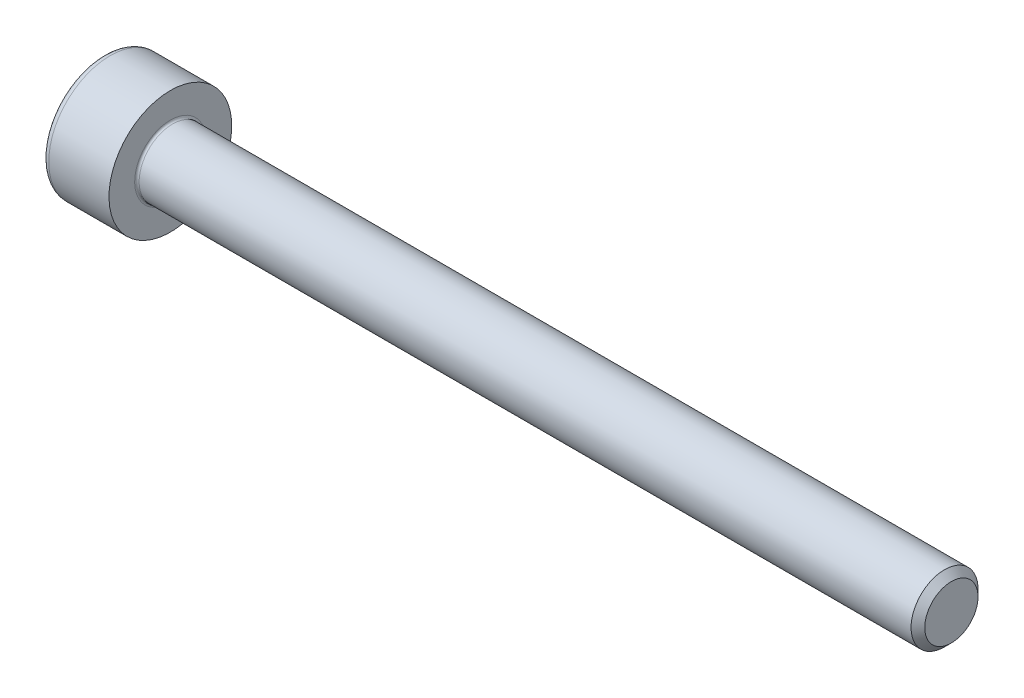
ISO-10303-21;
HEADER;
FILE_DESCRIPTION(('STEP AP214'),'2;1');
FILE_NAME('part.step','',(''),(''),'','','');
FILE_SCHEMA(('AUTOMOTIVE_DESIGN { 1 0 10303 214 1 1 1 1 }'));
ENDSEC;
DATA;
#1=APPLICATION_CONTEXT('core data for automotive mechanical design processes');
#2=APPLICATION_PROTOCOL_DEFINITION('international standard','automotive_design',2000,#1);
#3=PRODUCT_CONTEXT('',#1,'mechanical');
#4=PRODUCT('Part','Part','',(#3));
#5=PRODUCT_RELATED_PRODUCT_CATEGORY('part','',(#4));
#6=PRODUCT_DEFINITION_FORMATION('','',#4);
#7=PRODUCT_DEFINITION_CONTEXT('part definition',#1,'design');
#8=PRODUCT_DEFINITION('design','',#6,#7);
#9=PRODUCT_DEFINITION_SHAPE('','',#8);
#10=(LENGTH_UNIT() NAMED_UNIT(*) SI_UNIT(.MILLI.,.METRE.));
#11=(NAMED_UNIT(*) PLANE_ANGLE_UNIT() SI_UNIT($,.RADIAN.));
#12=(NAMED_UNIT(*) SI_UNIT($,.STERADIAN.) SOLID_ANGLE_UNIT());
#13=UNCERTAINTY_MEASURE_WITH_UNIT(LENGTH_MEASURE(1.E-05),#10,'distance_accuracy_value','');
#14=(GEOMETRIC_REPRESENTATION_CONTEXT(3) GLOBAL_UNCERTAINTY_ASSIGNED_CONTEXT((#13)) GLOBAL_UNIT_ASSIGNED_CONTEXT((#10,
#11,#12)) REPRESENTATION_CONTEXT('',''));
#15=CARTESIAN_POINT('',(0.,0.,0.));
#16=DIRECTION('',(0.,0.,1.));
#17=DIRECTION('',(1.,0.,0.));
#18=AXIS2_PLACEMENT_3D('',#15,#16,#17);
#19=CARTESIAN_POINT('',(0.100000000000002,0.,0.));
#20=DIRECTION('',(1.,0.,0.));
#21=DIRECTION('',(0.,1.,0.));
#22=AXIS2_PLACEMENT_3D('',#19,#20,#21);
#23=TOROIDAL_SURFACE('',#22,1.6,0.1);
#24=CARTESIAN_POINT('',(0.,0.,0.));
#25=DIRECTION('',(1.,0.,0.));
#26=DIRECTION('',(0.,1.,0.));
#27=AXIS2_PLACEMENT_3D('',#24,#25,#26);
#28=CIRCLE('',#27,1.6);
#29=CARTESIAN_POINT('',(0.,1.6,0.));
#30=VERTEX_POINT('',#29);
#31=EDGE_CURVE('E11',#30,#30,#28,.T.);
#32=ORIENTED_EDGE('',*,*,#31,.T.);
#33=EDGE_LOOP('',(#32));
#34=FACE_BOUND('',#33,.T.);
#35=CARTESIAN_POINT('',(0.100000000000002,0.,0.));
#36=DIRECTION('',(-1.,0.,0.));
#37=DIRECTION('',(0.,1.,0.));
#38=AXIS2_PLACEMENT_3D('',#35,#36,#37);
#39=CIRCLE('',#38,1.5);
#40=CARTESIAN_POINT('',(0.100000000000002,1.5,0.));
#41=VERTEX_POINT('',#40);
#42=EDGE_CURVE('E27',#41,#41,#39,.T.);
#43=ORIENTED_EDGE('',*,*,#42,.T.);
#44=EDGE_LOOP('',(#43));
#45=FACE_BOUND('',#44,.T.);
#46=ADVANCED_FACE('F16',(#34,#45),#23,.F.);
#47=CARTESIAN_POINT('',(26.,0.,0.));
#48=DIRECTION('',(1.,0.,0.));
#49=DIRECTION('',(0.,1.,0.));
#50=AXIS2_PLACEMENT_3D('',#47,#48,#49);
#51=CYLINDRICAL_SURFACE('',#50,1.5);
#52=CARTESIAN_POINT('',(34.693275,0.,0.));
#53=DIRECTION('',(1.,0.,0.));
#54=DIRECTION('',(0.,1.,0.));
#55=AXIS2_PLACEMENT_3D('',#52,#53,#54);
#56=CIRCLE('',#55,1.5);
#57=CARTESIAN_POINT('',(34.693275,1.5,0.));
#58=VERTEX_POINT('',#57);
#59=EDGE_CURVE('E161',#58,#58,#56,.T.);
#60=ORIENTED_EDGE('',*,*,#59,.F.);
#61=EDGE_LOOP('',(#60));
#62=FACE_BOUND('',#61,.T.);
#63=ORIENTED_EDGE('',*,*,#42,.F.);
#64=EDGE_LOOP('',(#63));
#65=FACE_BOUND('',#64,.T.);
#66=ADVANCED_FACE('F171',(#62,#65),#51,.T.);
#67=CARTESIAN_POINT('',(0.,2.125,0.));
#68=DIRECTION('',(1.,0.,0.));
#69=DIRECTION('',(0.,1.,0.));
#70=AXIS2_PLACEMENT_3D('',#67,#68,#69);
#71=PLANE('',#70);
#72=CARTESIAN_POINT('',(0.,0.,0.));
#73=DIRECTION('',(1.,0.,0.));
#74=DIRECTION('',(0.,1.,0.));
#75=AXIS2_PLACEMENT_3D('',#72,#73,#74);
#76=CIRCLE('',#75,2.75);
#77=CARTESIAN_POINT('',(0.,2.75,0.));
#78=VERTEX_POINT('',#77);
#79=EDGE_CURVE('E162',#78,#78,#76,.T.);
#80=ORIENTED_EDGE('',*,*,#79,.T.);
#81=EDGE_LOOP('',(#80));
#82=FACE_BOUND('',#81,.T.);
#83=ORIENTED_EDGE('',*,*,#31,.F.);
#84=EDGE_LOOP('',(#83));
#85=FACE_BOUND('',#84,.T.);
#86=ADVANCED_FACE('F173',(#82,#85),#71,.T.);
#87=CARTESIAN_POINT('',(34.8466375,0.,0.));
#88=DIRECTION('',(-1.,0.,0.));
#89=DIRECTION('',(0.,1.,0.));
#90=AXIS2_PLACEMENT_3D('',#87,#88,#89);
#91=CONICAL_SURFACE('',#90,1.3466375,0.785398163397445);
#92=ORIENTED_EDGE('',*,*,#59,.T.);
#93=EDGE_LOOP('',(#92));
#94=FACE_BOUND('',#93,.T.);
#95=CARTESIAN_POINT('',(35.,0.,0.));
#96=DIRECTION('',(-1.,0.,0.));
#97=DIRECTION('',(0.,1.,0.));
#98=AXIS2_PLACEMENT_3D('',#95,#96,#97);
#99=CIRCLE('',#98,1.193275);
#100=CARTESIAN_POINT('',(35.,1.193275,0.));
#101=VERTEX_POINT('',#100);
#102=EDGE_CURVE('E158',#101,#101,#99,.T.);
#103=ORIENTED_EDGE('',*,*,#102,.T.);
#104=EDGE_LOOP('',(#103));
#105=FACE_BOUND('',#104,.T.);
#106=ADVANCED_FACE('F181',(#94,#105),#91,.T.);
#107=CARTESIAN_POINT('',(35.,0.750000000000001,0.));
#108=DIRECTION('',(1.,0.,0.));
#109=DIRECTION('',(0.,1.,0.));
#110=AXIS2_PLACEMENT_3D('',#107,#108,#109);
#111=PLANE('',#110);
#112=ORIENTED_EDGE('',*,*,#102,.F.);
#113=EDGE_LOOP('',(#112));
#114=FACE_BOUND('',#113,.T.);
#115=ADVANCED_FACE('F191',(#114),#111,.T.);
#116=CARTESIAN_POINT('',(-2.69999999999999,0.,0.));
#117=DIRECTION('',(1.,0.,0.));
#118=DIRECTION('',(0.,1.,0.));
#119=AXIS2_PLACEMENT_3D('',#116,#117,#118);
#120=TOROIDAL_SURFACE('',#119,2.45,0.3);
#121=CARTESIAN_POINT('',(-2.99999999999999,0.,0.));
#122=DIRECTION('',(1.,0.,0.));
#123=DIRECTION('',(0.,1.,0.));
#124=AXIS2_PLACEMENT_3D('',#121,#122,#123);
#125=CIRCLE('',#124,2.45);
#126=CARTESIAN_POINT('',(-2.99999999999999,2.45,0.));
#127=VERTEX_POINT('',#126);
#128=EDGE_CURVE('E155',#127,#127,#125,.T.);
#129=ORIENTED_EDGE('',*,*,#128,.T.);
#130=EDGE_LOOP('',(#129));
#131=FACE_BOUND('',#130,.T.);
#132=CARTESIAN_POINT('',(-2.69999999999999,0.,0.));
#133=DIRECTION('',(-1.,0.,0.));
#134=DIRECTION('',(0.,1.,0.));
#135=AXIS2_PLACEMENT_3D('',#132,#133,#134);
#136=CIRCLE('',#135,2.75);
#137=CARTESIAN_POINT('',(-2.69999999999999,2.75,0.));
#138=VERTEX_POINT('',#137);
#139=EDGE_CURVE('E152',#138,#138,#136,.T.);
#140=ORIENTED_EDGE('',*,*,#139,.T.);
#141=EDGE_LOOP('',(#140));
#142=FACE_BOUND('',#141,.T.);
#143=ADVANCED_FACE('F205',(#131,#142),#120,.T.);
#144=CARTESIAN_POINT('',(-2.99999999999999,2.09668783648703,0.));
#145=DIRECTION('',(-1.,0.,0.));
#146=DIRECTION('',(0.,-1.,0.));
#147=AXIS2_PLACEMENT_3D('',#144,#145,#146);
#148=PLANE('',#147);
#149=DIRECTION('',(0.,0.,1.));
#150=VECTOR('',#149,1.);
#151=CARTESIAN_POINT('',(-2.99999999999999,1.25,0.360843918243515));
#152=LINE('',#151,#150);
#153=CARTESIAN_POINT('',(-2.99999999999999,1.25,-0.721687836487033));
#154=VERTEX_POINT('',#153);
#155=CARTESIAN_POINT('',(-2.99999999999999,1.25,0.72168783648703));
#156=VERTEX_POINT('',#155);
#157=EDGE_CURVE('E150',#154,#156,#152,.T.);
#158=ORIENTED_EDGE('',*,*,#157,.T.);
#159=DIRECTION('',(0.,-0.866025403784438,0.500000000000001));
#160=VECTOR('',#159,1.);
#161=CARTESIAN_POINT('',(-2.99999999999999,0.3125,1.26295371385231));
#162=LINE('',#161,#160);
#163=CARTESIAN_POINT('',(-2.99999999999999,0.,1.44337567297406));
#164=VERTEX_POINT('',#163);
#165=EDGE_CURVE('E39',#156,#164,#162,.T.);
#166=ORIENTED_EDGE('',*,*,#165,.T.);
#167=DIRECTION('',(0.,-0.866025403784439,-0.5));
#168=VECTOR('',#167,1.);
#169=CARTESIAN_POINT('',(-2.99999999999999,-0.9375,0.902109795608791));
#170=LINE('',#169,#168);
#171=CARTESIAN_POINT('',(-2.99999999999999,-1.25,0.721687836487033));
#172=VERTEX_POINT('',#171);
#173=EDGE_CURVE('E95',#164,#172,#170,.T.);
#174=ORIENTED_EDGE('',*,*,#173,.T.);
#175=DIRECTION('',(0.,0.,-1.));
#176=VECTOR('',#175,1.);
#177=CARTESIAN_POINT('',(-2.99999999999999,-1.25,-0.360843918243516));
#178=LINE('',#177,#176);
#179=CARTESIAN_POINT('',(-2.99999999999999,-1.25,-0.721687836487032));
#180=VERTEX_POINT('',#179);
#181=EDGE_CURVE('E88',#172,#180,#178,.T.);
#182=ORIENTED_EDGE('',*,*,#181,.T.);
#183=DIRECTION('',(0.,0.866025403784439,-0.5));
#184=VECTOR('',#183,1.);
#185=CARTESIAN_POINT('',(-2.99999999999999,-0.3125,-1.26295371385231));
#186=LINE('',#185,#184);
#187=CARTESIAN_POINT('',(-2.99999999999999,0.,-1.44337567297406));
#188=VERTEX_POINT('',#187);
#189=EDGE_CURVE('E144',#180,#188,#186,.T.);
#190=ORIENTED_EDGE('',*,*,#189,.T.);
#191=DIRECTION('',(0.,0.866025403784439,0.5));
#192=VECTOR('',#191,1.);
#193=CARTESIAN_POINT('',(-2.99999999999999,0.9375,-0.902109795608791));
#194=LINE('',#193,#192);
#195=EDGE_CURVE('E135',#188,#154,#194,.T.);
#196=ORIENTED_EDGE('',*,*,#195,.T.);
#197=EDGE_LOOP('',(#158,#166,#174,#182,#190,#196));
#198=FACE_BOUND('',#197,.T.);
#199=ORIENTED_EDGE('',*,*,#128,.F.);
#200=EDGE_LOOP('',(#199));
#201=FACE_BOUND('',#200,.T.);
#202=ADVANCED_FACE('F196',(#198,#201),#148,.T.);
#203=CARTESIAN_POINT('',(-1.49999999999999,0.,0.));
#204=DIRECTION('',(1.,0.,0.));
#205=DIRECTION('',(0.,1.,0.));
#206=AXIS2_PLACEMENT_3D('',#203,#204,#205);
#207=CYLINDRICAL_SURFACE('',#206,2.75);
#208=ORIENTED_EDGE('',*,*,#79,.F.);
#209=EDGE_LOOP('',(#208));
#210=FACE_BOUND('',#209,.T.);
#211=ORIENTED_EDGE('',*,*,#139,.F.);
#212=EDGE_LOOP('',(#211));
#213=FACE_BOUND('',#212,.T.);
#214=ADVANCED_FACE('F193',(#210,#213),#207,.T.);
#215=CARTESIAN_POINT('',(-2.99999999999999,0.,-1.44337567297406));
#216=DIRECTION('',(0.,-0.5,-0.866025403784439));
#217=DIRECTION('',(0.,0.866025403784439,-0.5));
#218=AXIS2_PLACEMENT_3D('',#215,#216,#217);
#219=PLANE('',#218);
#220=CARTESIAN_POINT('',(-1.49999999999999,0.,-1.44337567297407));
#221=CARTESIAN_POINT('',(-1.29166666666665,-0.625000000000001,-1.08253175473055));
#222=CARTESIAN_POINT('',(-1.49999999999999,-1.25000000000001,-0.721687836487024));
#223=(BOUNDED_CURVE() B_SPLINE_CURVE(2,(#220,#221,#222),.UNSPECIFIED.,.F.,
.F.) B_SPLINE_CURVE_WITH_KNOTS((3,3),(0.,0.146054517259743),
.UNSPECIFIED.) CURVE() GEOMETRIC_REPRESENTATION_ITEM() RATIONAL_B_SPLINE_CURVE((1.,
1.15470053837926,1.)) REPRESENTATION_ITEM(''));
#224=CARTESIAN_POINT('',(-1.49999999999999,0.,-1.44337567297406));
#225=VERTEX_POINT('',#224);
#226=CARTESIAN_POINT('',(-1.49999999999999,-1.25,-0.721687836487032));
#227=VERTEX_POINT('',#226);
#228=EDGE_CURVE('E79',#225,#227,#223,.T.);
#229=ORIENTED_EDGE('',*,*,#228,.F.);
#230=DIRECTION('',(-1.,0.,0.));
#231=VECTOR('',#230,1.);
#232=CARTESIAN_POINT('',(-2.24999999999999,0.,-1.44337567297406));
#233=LINE('',#232,#231);
#234=EDGE_CURVE('E125',#225,#188,#233,.T.);
#235=ORIENTED_EDGE('',*,*,#234,.T.);
#236=ORIENTED_EDGE('',*,*,#189,.F.);
#237=DIRECTION('',(-1.,0.,0.));
#238=VECTOR('',#237,1.);
#239=CARTESIAN_POINT('',(-2.24999999999999,-1.25,-0.721687836487033));
#240=LINE('',#239,#238);
#241=EDGE_CURVE('E91',#227,#180,#240,.T.);
#242=ORIENTED_EDGE('',*,*,#241,.F.);
#243=EDGE_LOOP('',(#229,#235,#236,#242));
#244=FACE_BOUND('',#243,.T.);
#245=ADVANCED_FACE('F195',(#244),#219,.F.);
#246=CARTESIAN_POINT('',(-2.99999999999999,1.25,-0.721687836487033));
#247=DIRECTION('',(0.,0.5,-0.866025403784439));
#248=DIRECTION('',(0.,0.866025403784439,0.5));
#249=AXIS2_PLACEMENT_3D('',#246,#247,#248);
#250=PLANE('',#249);
#251=CARTESIAN_POINT('',(-1.49999999999999,1.25000000000001,-0.721687836487025));
#252=CARTESIAN_POINT('',(-1.29166666666665,0.625,-1.08253175473055));
#253=CARTESIAN_POINT('',(-1.49999999999999,0.,-1.44337567297407));
#254=(BOUNDED_CURVE() B_SPLINE_CURVE(2,(#251,#252,#253),.UNSPECIFIED.,.F.,
.F.) B_SPLINE_CURVE_WITH_KNOTS((3,3),(0.,0.146054517259743),
.UNSPECIFIED.) CURVE() GEOMETRIC_REPRESENTATION_ITEM() RATIONAL_B_SPLINE_CURVE((1.,
1.15470053837926,1.)) REPRESENTATION_ITEM(''));
#255=CARTESIAN_POINT('',(-1.49999999999999,1.25,-0.721687836487035));
#256=VERTEX_POINT('',#255);
#257=EDGE_CURVE('E119',#256,#225,#254,.T.);
#258=ORIENTED_EDGE('',*,*,#257,.F.);
#259=DIRECTION('',(-1.,0.,0.));
#260=VECTOR('',#259,1.);
#261=CARTESIAN_POINT('',(-2.24999999999999,1.25,-0.721687836487034));
#262=LINE('',#261,#260);
#263=EDGE_CURVE('E114',#256,#154,#262,.T.);
#264=ORIENTED_EDGE('',*,*,#263,.T.);
#265=ORIENTED_EDGE('',*,*,#195,.F.);
#266=ORIENTED_EDGE('',*,*,#234,.F.);
#267=EDGE_LOOP('',(#258,#264,#265,#266));
#268=FACE_BOUND('',#267,.T.);
#269=ADVANCED_FACE('F202',(#268),#250,.F.);
#270=CARTESIAN_POINT('',(-2.99999999999999,1.25,0.72168783648703));
#271=DIRECTION('',(0.,1.,0.));
#272=DIRECTION('',(0.,0.,1.));
#273=AXIS2_PLACEMENT_3D('',#270,#271,#272);
#274=PLANE('',#273);
#275=CARTESIAN_POINT('',(-1.49999999999999,1.25,0.721687836487046));
#276=CARTESIAN_POINT('',(-1.29166666666665,1.25,0.));
#277=CARTESIAN_POINT('',(-1.49999999999999,1.25,-0.721687836487049));
#278=(BOUNDED_CURVE() B_SPLINE_CURVE(2,(#275,#276,#277),.UNSPECIFIED.,.F.,
.F.) B_SPLINE_CURVE_WITH_KNOTS((3,3),(0.,0.146054517259743),
.UNSPECIFIED.) CURVE() GEOMETRIC_REPRESENTATION_ITEM() RATIONAL_B_SPLINE_CURVE((1.,
1.15470053837925,1.)) REPRESENTATION_ITEM(''));
#279=CARTESIAN_POINT('',(-1.49999999999999,1.25,0.72168783648703));
#280=VERTEX_POINT('',#279);
#281=EDGE_CURVE('E98',#280,#256,#278,.T.);
#282=ORIENTED_EDGE('',*,*,#281,.F.);
#283=DIRECTION('',(-1.,0.,0.));
#284=VECTOR('',#283,1.);
#285=CARTESIAN_POINT('',(-2.24999999999999,1.25,0.72168783648703));
#286=LINE('',#285,#284);
#287=EDGE_CURVE('E108',#280,#156,#286,.T.);
#288=ORIENTED_EDGE('',*,*,#287,.T.);
#289=ORIENTED_EDGE('',*,*,#157,.F.);
#290=ORIENTED_EDGE('',*,*,#263,.F.);
#291=EDGE_LOOP('',(#282,#288,#289,#290));
#292=FACE_BOUND('',#291,.T.);
#293=ADVANCED_FACE('F223',(#292),#274,.F.);
#294=CARTESIAN_POINT('',(-2.99999999999999,0.,1.44337567297406));
#295=DIRECTION('',(0.,0.500000000000001,0.866025403784438));
#296=DIRECTION('',(0.,-0.866025403784438,0.500000000000001));
#297=AXIS2_PLACEMENT_3D('',#294,#295,#296);
#298=PLANE('',#297);
#299=CARTESIAN_POINT('',(-1.49999999999999,0.,1.44337567297407));
#300=CARTESIAN_POINT('',(-1.29166666666665,0.625,1.08253175473055));
#301=CARTESIAN_POINT('',(-1.49999999999999,1.25000000000002,0.721687836487022));
#302=(BOUNDED_CURVE() B_SPLINE_CURVE(2,(#299,#300,#301),.UNSPECIFIED.,.F.,
.F.) B_SPLINE_CURVE_WITH_KNOTS((3,3),(0.,0.146054517259743),
.UNSPECIFIED.) CURVE() GEOMETRIC_REPRESENTATION_ITEM() RATIONAL_B_SPLINE_CURVE((1.,
1.15470053837926,1.)) REPRESENTATION_ITEM(''));
#303=CARTESIAN_POINT('',(-1.49999999999999,0.,1.44337567297406));
#304=VERTEX_POINT('',#303);
#305=EDGE_CURVE('E96',#304,#280,#302,.T.);
#306=ORIENTED_EDGE('',*,*,#305,.F.);
#307=DIRECTION('',(1.,0.,0.));
#308=VECTOR('',#307,1.);
#309=CARTESIAN_POINT('',(-2.24999999999999,0.,1.44337567297406));
#310=LINE('',#309,#308);
#311=EDGE_CURVE('E92',#164,#304,#310,.T.);
#312=ORIENTED_EDGE('',*,*,#311,.F.);
#313=ORIENTED_EDGE('',*,*,#165,.F.);
#314=ORIENTED_EDGE('',*,*,#287,.F.);
#315=EDGE_LOOP('',(#306,#312,#313,#314));
#316=FACE_BOUND('',#315,.T.);
#317=ADVANCED_FACE('F227',(#316),#298,.F.);
#318=CARTESIAN_POINT('',(-2.99999999999999,-1.25,-0.721687836487032));
#319=DIRECTION('',(0.,-1.,0.));
#320=DIRECTION('',(1.,0.,0.));
#321=AXIS2_PLACEMENT_3D('',#318,#319,#320);
#322=PLANE('',#321);
#323=CARTESIAN_POINT('',(-1.49999999999999,-1.25,-0.721687836487048));
#324=CARTESIAN_POINT('',(-1.29166666666665,-1.25,0.));
#325=CARTESIAN_POINT('',(-1.49999999999999,-1.25,0.721687836487048));
#326=(BOUNDED_CURVE() B_SPLINE_CURVE(2,(#323,#324,#325),.UNSPECIFIED.,.F.,
.F.) B_SPLINE_CURVE_WITH_KNOTS((3,3),(0.,0.146054517259743),
.UNSPECIFIED.) CURVE() GEOMETRIC_REPRESENTATION_ITEM() RATIONAL_B_SPLINE_CURVE((1.,
1.15470053837926,1.)) REPRESENTATION_ITEM(''));
#327=CARTESIAN_POINT('',(-1.49999999999999,-1.25,0.721687836487032));
#328=VERTEX_POINT('',#327);
#329=EDGE_CURVE('E74',#227,#328,#326,.T.);
#330=ORIENTED_EDGE('',*,*,#329,.F.);
#331=ORIENTED_EDGE('',*,*,#241,.T.);
#332=ORIENTED_EDGE('',*,*,#181,.F.);
#333=DIRECTION('',(-1.,0.,0.));
#334=VECTOR('',#333,1.);
#335=CARTESIAN_POINT('',(-2.24999999999999,-1.25,0.721687836487032));
#336=LINE('',#335,#334);
#337=EDGE_CURVE('E85',#328,#172,#336,.T.);
#338=ORIENTED_EDGE('',*,*,#337,.F.);
#339=EDGE_LOOP('',(#330,#331,#332,#338));
#340=FACE_BOUND('',#339,.T.);
#341=ADVANCED_FACE('F86',(#340),#322,.F.);
#342=CARTESIAN_POINT('',(-2.99999999999999,-1.25,0.721687836487033));
#343=DIRECTION('',(0.,-0.5,0.866025403784439));
#344=DIRECTION('',(0.,-0.866025403784439,-0.5));
#345=AXIS2_PLACEMENT_3D('',#342,#343,#344);
#346=PLANE('',#345);
#347=CARTESIAN_POINT('',(-1.49999999999999,-1.25000000000001,0.721687836487025));
#348=CARTESIAN_POINT('',(-1.29166666666665,-0.625,1.08253175473055));
#349=CARTESIAN_POINT('',(-1.49999999999999,0.,1.44337567297407));
#350=(BOUNDED_CURVE() B_SPLINE_CURVE(2,(#347,#348,#349),.UNSPECIFIED.,.F.,
.F.) B_SPLINE_CURVE_WITH_KNOTS((3,3),(0.,0.146054517259743),
.UNSPECIFIED.) CURVE() GEOMETRIC_REPRESENTATION_ITEM() RATIONAL_B_SPLINE_CURVE((1.,
1.15470053837926,1.)) REPRESENTATION_ITEM(''));
#351=EDGE_CURVE('E20',#328,#304,#350,.T.);
#352=ORIENTED_EDGE('',*,*,#351,.F.);
#353=ORIENTED_EDGE('',*,*,#337,.T.);
#354=ORIENTED_EDGE('',*,*,#173,.F.);
#355=ORIENTED_EDGE('',*,*,#311,.T.);
#356=EDGE_LOOP('',(#352,#353,#354,#355));
#357=FACE_BOUND('',#356,.T.);
#358=ADVANCED_FACE('F94',(#357),#346,.F.);
#359=CARTESIAN_POINT('',(-1.08333333333333,0.,0.));
#360=DIRECTION('',(-1.,0.,0.));
#361=DIRECTION('',(0.,1.,0.));
#362=AXIS2_PLACEMENT_3D('',#359,#360,#361);
#363=CONICAL_SURFACE('',#362,0.721687836487032,1.0471975511966);
#364=CARTESIAN_POINT('',(-0.66666666666666,0.,0.));
#365=VERTEX_POINT('',#364);
#366=VERTEX_LOOP('',#365);
#367=FACE_BOUND('',#366,.T.);
#368=ORIENTED_EDGE('',*,*,#305,.T.);
#369=ORIENTED_EDGE('',*,*,#281,.T.);
#370=ORIENTED_EDGE('',*,*,#257,.T.);
#371=ORIENTED_EDGE('',*,*,#228,.T.);
#372=ORIENTED_EDGE('',*,*,#329,.T.);
#373=ORIENTED_EDGE('',*,*,#351,.T.);
#374=EDGE_LOOP('',(#368,#369,#370,#371,#372,#373));
#375=FACE_BOUND('',#374,.T.);
#376=ADVANCED_FACE('F18',(#367,#375),#363,.F.);
#377=CLOSED_SHELL('',(#46,#66,#86,#106,#115,#143,#202,#214,#245,#269,#293,#317,#341,#358,#376));
#378=MANIFOLD_SOLID_BREP('B1',#377);
#379=ADVANCED_BREP_SHAPE_REPRESENTATION('',(#18,#378),#14);
#380=SHAPE_DEFINITION_REPRESENTATION(#9,#379);
ENDSEC;
END-ISO-10303-21;
